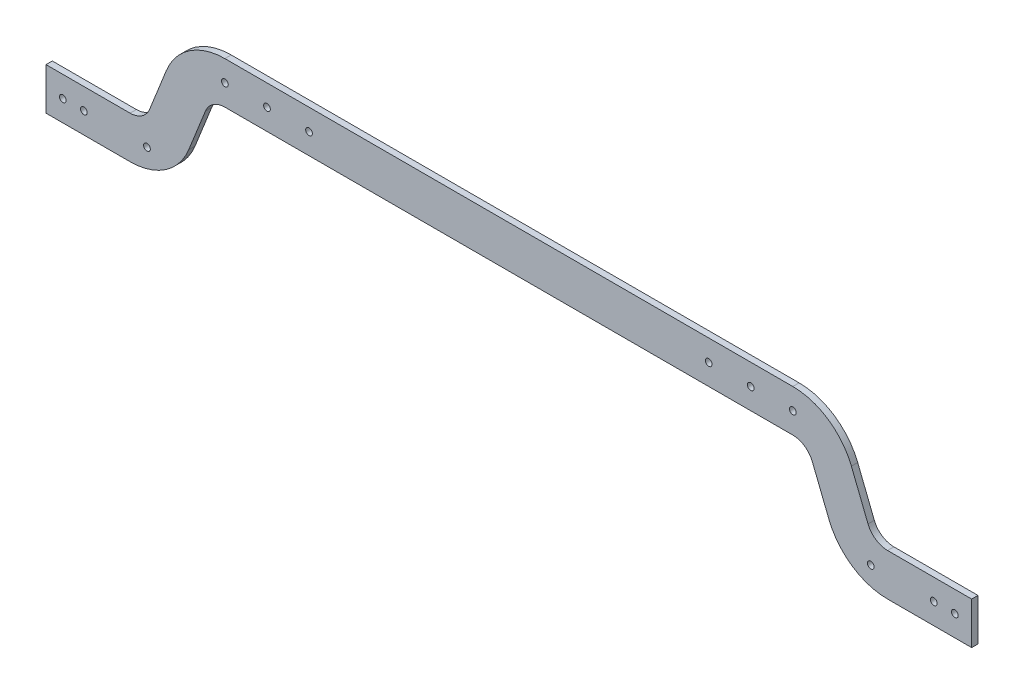
ISO-10303-21;
HEADER;
FILE_DESCRIPTION(('STEP AP214'),'2;1');
FILE_NAME('part.step','',(''),(''),'','','');
FILE_SCHEMA(('AUTOMOTIVE_DESIGN { 1 0 10303 214 1 1 1 1 }'));
ENDSEC;
DATA;
#1=APPLICATION_CONTEXT('core data for automotive mechanical design processes');
#2=APPLICATION_PROTOCOL_DEFINITION('international standard','automotive_design',2000,#1);
#3=PRODUCT_CONTEXT('',#1,'mechanical');
#4=PRODUCT('Part','Part','',(#3));
#5=PRODUCT_RELATED_PRODUCT_CATEGORY('part','',(#4));
#6=PRODUCT_DEFINITION_FORMATION('','',#4);
#7=PRODUCT_DEFINITION_CONTEXT('part definition',#1,'design');
#8=PRODUCT_DEFINITION('design','',#6,#7);
#9=PRODUCT_DEFINITION_SHAPE('','',#8);
#10=(LENGTH_UNIT() NAMED_UNIT(*) SI_UNIT(.MILLI.,.METRE.));
#11=(NAMED_UNIT(*) PLANE_ANGLE_UNIT() SI_UNIT($,.RADIAN.));
#12=(NAMED_UNIT(*) SI_UNIT($,.STERADIAN.) SOLID_ANGLE_UNIT());
#13=UNCERTAINTY_MEASURE_WITH_UNIT(LENGTH_MEASURE(1.E-05),#10,'distance_accuracy_value','');
#14=(GEOMETRIC_REPRESENTATION_CONTEXT(3) GLOBAL_UNCERTAINTY_ASSIGNED_CONTEXT((#13)) GLOBAL_UNIT_ASSIGNED_CONTEXT((#10,
#11,#12)) REPRESENTATION_CONTEXT('',''));
#15=CARTESIAN_POINT('',(0.,0.,0.));
#16=DIRECTION('',(0.,0.,1.));
#17=DIRECTION('',(1.,0.,0.));
#18=AXIS2_PLACEMENT_3D('',#15,#16,#17);
#19=CARTESIAN_POINT('',(-512.555561166034,145.,3.));
#20=DIRECTION('',(1.,0.,0.));
#21=DIRECTION('',(0.,0.,-1.));
#22=AXIS2_PLACEMENT_3D('',#19,#20,#21);
#23=PLANE('',#22);
#24=DIRECTION('',(0.,-1.,0.));
#25=VECTOR('',#24,1.);
#26=CARTESIAN_POINT('',(-512.555561166034,145.,0.));
#27=LINE('',#26,#25);
#28=CARTESIAN_POINT('',(-512.555561166034,165.,0.));
#29=VERTEX_POINT('',#28);
#30=CARTESIAN_POINT('',(-512.555561166034,145.,0.));
#31=VERTEX_POINT('',#30);
#32=EDGE_CURVE('E217',#29,#31,#27,.T.);
#33=ORIENTED_EDGE('',*,*,#32,.T.);
#34=DIRECTION('',(0.,0.,-1.));
#35=VECTOR('',#34,1.);
#36=CARTESIAN_POINT('',(-512.555561166034,145.,3.));
#37=LINE('',#36,#35);
#38=CARTESIAN_POINT('',(-512.555561166034,145.,3.));
#39=VERTEX_POINT('',#38);
#40=EDGE_CURVE('E13',#39,#31,#37,.T.);
#41=ORIENTED_EDGE('',*,*,#40,.F.);
#42=DIRECTION('',(0.,-1.,0.));
#43=VECTOR('',#42,1.);
#44=CARTESIAN_POINT('',(-512.555561166034,145.,3.));
#45=LINE('',#44,#43);
#46=CARTESIAN_POINT('',(-512.555561166034,165.,3.));
#47=VERTEX_POINT('',#46);
#48=EDGE_CURVE('E256',#47,#39,#45,.T.);
#49=ORIENTED_EDGE('',*,*,#48,.F.);
#50=DIRECTION('',(0.,0.,-1.));
#51=VECTOR('',#50,1.);
#52=CARTESIAN_POINT('',(-512.555561166034,165.,3.));
#53=LINE('',#52,#51);
#54=EDGE_CURVE('E213',#47,#29,#53,.T.);
#55=ORIENTED_EDGE('',*,*,#54,.T.);
#56=EDGE_LOOP('',(#33,#41,#49,#55));
#57=FACE_BOUND('',#56,.T.);
#58=ADVANCED_FACE('F49',(#57),#23,.F.);
#59=CARTESIAN_POINT('',(-512.555561166034,145.,3.));
#60=DIRECTION('',(0.,1.,0.));
#61=DIRECTION('',(0.,0.,1.));
#62=AXIS2_PLACEMENT_3D('',#59,#60,#61);
#63=PLANE('',#62);
#64=DIRECTION('',(1.,0.,0.));
#65=VECTOR('',#64,1.);
#66=CARTESIAN_POINT('',(-512.555561166034,145.,0.));
#67=LINE('',#66,#65);
#68=CARTESIAN_POINT('',(-472.555561166034,145.,0.));
#69=VERTEX_POINT('',#68);
#70=EDGE_CURVE('E220',#31,#69,#67,.T.);
#71=ORIENTED_EDGE('',*,*,#70,.T.);
#72=DIRECTION('',(0.,0.,-1.));
#73=VECTOR('',#72,1.);
#74=CARTESIAN_POINT('',(-472.555561166034,145.,3.));
#75=LINE('',#74,#73);
#76=CARTESIAN_POINT('',(-472.555561166034,145.,3.));
#77=VERTEX_POINT('',#76);
#78=EDGE_CURVE('E57',#77,#69,#75,.T.);
#79=ORIENTED_EDGE('',*,*,#78,.F.);
#80=DIRECTION('',(1.,0.,0.));
#81=VECTOR('',#80,1.);
#82=CARTESIAN_POINT('',(-512.555561166034,145.,3.));
#83=LINE('',#82,#81);
#84=EDGE_CURVE('E144',#39,#77,#83,.T.);
#85=ORIENTED_EDGE('',*,*,#84,.F.);
#86=ORIENTED_EDGE('',*,*,#40,.T.);
#87=EDGE_LOOP('',(#71,#79,#85,#86));
#88=FACE_BOUND('',#87,.T.);
#89=ADVANCED_FACE('F375',(#88),#63,.F.);
#90=CARTESIAN_POINT('',(-472.555561166034,175.,3.));
#91=DIRECTION('',(0.,0.,-1.));
#92=DIRECTION('',(-1.,0.,0.));
#93=AXIS2_PLACEMENT_3D('',#90,#91,#92);
#94=CYLINDRICAL_SURFACE('',#93,29.9999999999998);
#95=CARTESIAN_POINT('',(-472.555561166034,175.,0.));
#96=DIRECTION('',(0.,0.,1.));
#97=DIRECTION('',(1.,0.,0.));
#98=AXIS2_PLACEMENT_3D('',#95,#96,#97);
#99=CIRCLE('',#98,29.9999999999998);
#100=CARTESIAN_POINT('',(-444.689840432414,163.886872267632,0.));
#101=VERTEX_POINT('',#100);
#102=EDGE_CURVE('E223',#69,#101,#99,.T.);
#103=ORIENTED_EDGE('',*,*,#102,.T.);
#104=DIRECTION('',(0.,0.,-1.));
#105=VECTOR('',#104,1.);
#106=CARTESIAN_POINT('',(-444.689840432414,163.886872267632,3.));
#107=LINE('',#106,#105);
#108=CARTESIAN_POINT('',(-444.689840432414,163.886872267632,3.));
#109=VERTEX_POINT('',#108);
#110=EDGE_CURVE('E299',#109,#101,#107,.T.);
#111=ORIENTED_EDGE('',*,*,#110,.F.);
#112=CARTESIAN_POINT('',(-472.555561166034,175.,3.));
#113=DIRECTION('',(0.,0.,1.));
#114=DIRECTION('',(1.,0.,0.));
#115=AXIS2_PLACEMENT_3D('',#112,#113,#114);
#116=CIRCLE('',#115,29.9999999999998);
#117=EDGE_CURVE('E307',#77,#109,#116,.T.);
#118=ORIENTED_EDGE('',*,*,#117,.F.);
#119=ORIENTED_EDGE('',*,*,#78,.T.);
#120=EDGE_LOOP('',(#103,#111,#118,#119));
#121=FACE_BOUND('',#120,.T.);
#122=ADVANCED_FACE('F305',(#121),#94,.T.);
#123=CARTESIAN_POINT('',(-436.785621791445,183.706382541521,3.));
#124=DIRECTION('',(-0.928857357787315,0.370437591078939,0.));
#125=DIRECTION('',(-0.370437591078939,-0.928857357787315,0.));
#126=AXIS2_PLACEMENT_3D('',#123,#124,#125);
#127=PLANE('',#126);
#128=DIRECTION('',(0.370437591078939,0.928857357787315,0.));
#129=VECTOR('',#128,1.);
#130=CARTESIAN_POINT('',(-436.785621791445,183.706382541521,0.));
#131=LINE('',#130,#129);
#132=CARTESIAN_POINT('',(-436.785621791445,183.706382541521,0.));
#133=VERTEX_POINT('',#132);
#134=EDGE_CURVE('E225',#101,#133,#131,.T.);
#135=ORIENTED_EDGE('',*,*,#134,.T.);
#136=DIRECTION('',(0.,0.,-1.));
#137=VECTOR('',#136,1.);
#138=CARTESIAN_POINT('',(-436.785621791445,183.706382541521,3.));
#139=LINE('',#138,#137);
#140=CARTESIAN_POINT('',(-436.785621791445,183.706382541521,3.));
#141=VERTEX_POINT('',#140);
#142=EDGE_CURVE('E296',#141,#133,#139,.T.);
#143=ORIENTED_EDGE('',*,*,#142,.F.);
#144=DIRECTION('',(0.370437591078939,0.928857357787315,0.));
#145=VECTOR('',#144,1.);
#146=CARTESIAN_POINT('',(-436.785621791445,183.706382541521,3.));
#147=LINE('',#146,#145);
#148=EDGE_CURVE('E325',#109,#141,#147,.T.);
#149=ORIENTED_EDGE('',*,*,#148,.F.);
#150=ORIENTED_EDGE('',*,*,#110,.T.);
#151=EDGE_LOOP('',(#135,#143,#149,#150));
#152=FACE_BOUND('',#151,.T.);
#153=ADVANCED_FACE('F316',(#152),#127,.F.);
#154=CARTESIAN_POINT('',(-427.497048213572,180.002006630731,3.));
#155=DIRECTION('',(0.,0.,-1.));
#156=DIRECTION('',(-1.,0.,0.));
#157=AXIS2_PLACEMENT_3D('',#154,#155,#156);
#158=CYLINDRICAL_SURFACE('',#157,10.);
#159=CARTESIAN_POINT('',(-427.497048213572,180.002006630731,0.));
#160=DIRECTION('',(0.,0.,-1.));
#161=DIRECTION('',(1.,0.,0.));
#162=AXIS2_PLACEMENT_3D('',#159,#160,#161);
#163=CIRCLE('',#162,10.);
#164=CARTESIAN_POINT('',(-427.497048213572,190.002006630731,0.));
#165=VERTEX_POINT('',#164);
#166=EDGE_CURVE('E227',#133,#165,#163,.T.);
#167=ORIENTED_EDGE('',*,*,#166,.T.);
#168=DIRECTION('',(0.,0.,-1.));
#169=VECTOR('',#168,1.);
#170=CARTESIAN_POINT('',(-427.497048213572,190.002006630731,3.));
#171=LINE('',#170,#169);
#172=CARTESIAN_POINT('',(-427.497048213572,190.002006630731,3.));
#173=VERTEX_POINT('',#172);
#174=EDGE_CURVE('E293',#173,#165,#171,.T.);
#175=ORIENTED_EDGE('',*,*,#174,.F.);
#176=CARTESIAN_POINT('',(-427.497048213572,180.002006630731,3.));
#177=DIRECTION('',(0.,0.,-1.));
#178=DIRECTION('',(1.,0.,0.));
#179=AXIS2_PLACEMENT_3D('',#176,#177,#178);
#180=CIRCLE('',#179,10.);
#181=EDGE_CURVE('E322',#141,#173,#180,.T.);
#182=ORIENTED_EDGE('',*,*,#181,.F.);
#183=ORIENTED_EDGE('',*,*,#142,.T.);
#184=EDGE_LOOP('',(#167,#175,#182,#183));
#185=FACE_BOUND('',#184,.T.);
#186=ADVANCED_FACE('F320',(#185),#158,.F.);
#187=CARTESIAN_POINT('',(-157.497048213572,190.002006630731,3.));
#188=DIRECTION('',(0.,1.,0.));
#189=DIRECTION('',(0.,0.,1.));
#190=AXIS2_PLACEMENT_3D('',#187,#188,#189);
#191=PLANE('',#190);
#192=DIRECTION('',(1.,0.,0.));
#193=VECTOR('',#192,1.);
#194=CARTESIAN_POINT('',(-157.497048213572,190.002006630731,0.));
#195=LINE('',#194,#193);
#196=CARTESIAN_POINT('',(-157.497048213572,190.002006630731,0.));
#197=VERTEX_POINT('',#196);
#198=EDGE_CURVE('E229',#165,#197,#195,.T.);
#199=ORIENTED_EDGE('',*,*,#198,.T.);
#200=DIRECTION('',(0.,0.,-1.));
#201=VECTOR('',#200,1.);
#202=CARTESIAN_POINT('',(-157.497048213572,190.002006630731,3.));
#203=LINE('',#202,#201);
#204=CARTESIAN_POINT('',(-157.497048213572,190.002006630731,3.));
#205=VERTEX_POINT('',#204);
#206=EDGE_CURVE('E290',#205,#197,#203,.T.);
#207=ORIENTED_EDGE('',*,*,#206,.F.);
#208=DIRECTION('',(1.,0.,0.));
#209=VECTOR('',#208,1.);
#210=CARTESIAN_POINT('',(-157.497048213572,190.002006630731,3.));
#211=LINE('',#210,#209);
#212=EDGE_CURVE('E324',#173,#205,#211,.T.);
#213=ORIENTED_EDGE('',*,*,#212,.F.);
#214=ORIENTED_EDGE('',*,*,#174,.T.);
#215=EDGE_LOOP('',(#199,#207,#213,#214));
#216=FACE_BOUND('',#215,.T.);
#217=ADVANCED_FACE('F388',(#216),#191,.F.);
#218=CARTESIAN_POINT('',(-157.497048213572,180.002006630731,3.));
#219=DIRECTION('',(0.,0.,-1.));
#220=DIRECTION('',(-1.,0.,0.));
#221=AXIS2_PLACEMENT_3D('',#218,#219,#220);
#222=CYLINDRICAL_SURFACE('',#221,10.);
#223=CARTESIAN_POINT('',(-157.497048213572,180.002006630731,0.));
#224=DIRECTION('',(0.,0.,-1.));
#225=DIRECTION('',(-1.,0.,0.));
#226=AXIS2_PLACEMENT_3D('',#223,#224,#225);
#227=CIRCLE('',#226,10.);
#228=CARTESIAN_POINT('',(-148.208474635699,183.706382541521,0.));
#229=VERTEX_POINT('',#228);
#230=EDGE_CURVE('E231',#197,#229,#227,.T.);
#231=ORIENTED_EDGE('',*,*,#230,.T.);
#232=DIRECTION('',(0.,0.,-1.));
#233=VECTOR('',#232,1.);
#234=CARTESIAN_POINT('',(-148.208474635699,183.706382541521,3.));
#235=LINE('',#234,#233);
#236=CARTESIAN_POINT('',(-148.208474635699,183.706382541521,3.));
#237=VERTEX_POINT('',#236);
#238=EDGE_CURVE('E287',#237,#229,#235,.T.);
#239=ORIENTED_EDGE('',*,*,#238,.F.);
#240=CARTESIAN_POINT('',(-157.497048213572,180.002006630731,3.));
#241=DIRECTION('',(0.,0.,-1.));
#242=DIRECTION('',(-1.,0.,0.));
#243=AXIS2_PLACEMENT_3D('',#240,#241,#242);
#244=CIRCLE('',#243,10.);
#245=EDGE_CURVE('E327',#205,#237,#244,.T.);
#246=ORIENTED_EDGE('',*,*,#245,.F.);
#247=ORIENTED_EDGE('',*,*,#206,.T.);
#248=EDGE_LOOP('',(#231,#239,#246,#247));
#249=FACE_BOUND('',#248,.T.);
#250=ADVANCED_FACE('F391',(#249),#222,.F.);
#251=CARTESIAN_POINT('',(-148.208474635699,183.706382541521,3.));
#252=DIRECTION('',(0.928857357787315,0.370437591078939,0.));
#253=DIRECTION('',(-0.370437591078939,0.928857357787315,0.));
#254=AXIS2_PLACEMENT_3D('',#251,#252,#253);
#255=PLANE('',#254);
#256=DIRECTION('',(0.370437591078939,-0.928857357787315,0.));
#257=VECTOR('',#256,1.);
#258=CARTESIAN_POINT('',(-148.208474635699,183.706382541521,0.));
#259=LINE('',#258,#257);
#260=CARTESIAN_POINT('',(-140.30425599473,163.886872267632,0.));
#261=VERTEX_POINT('',#260);
#262=EDGE_CURVE('E233',#229,#261,#259,.T.);
#263=ORIENTED_EDGE('',*,*,#262,.T.);
#264=DIRECTION('',(0.,0.,-1.));
#265=VECTOR('',#264,1.);
#266=CARTESIAN_POINT('',(-140.30425599473,163.886872267632,3.));
#267=LINE('',#266,#265);
#268=CARTESIAN_POINT('',(-140.30425599473,163.886872267632,3.));
#269=VERTEX_POINT('',#268);
#270=EDGE_CURVE('E284',#269,#261,#267,.T.);
#271=ORIENTED_EDGE('',*,*,#270,.F.);
#272=DIRECTION('',(0.370437591078939,-0.928857357787315,0.));
#273=VECTOR('',#272,1.);
#274=CARTESIAN_POINT('',(-148.208474635699,183.706382541521,3.));
#275=LINE('',#274,#273);
#276=EDGE_CURVE('E333',#237,#269,#275,.T.);
#277=ORIENTED_EDGE('',*,*,#276,.F.);
#278=ORIENTED_EDGE('',*,*,#238,.T.);
#279=EDGE_LOOP('',(#263,#271,#277,#278));
#280=FACE_BOUND('',#279,.T.);
#281=ADVANCED_FACE('F395',(#280),#255,.F.);
#282=CARTESIAN_POINT('',(-112.438535261111,175.,3.));
#283=DIRECTION('',(0.,0.,-1.));
#284=DIRECTION('',(-1.,0.,0.));
#285=AXIS2_PLACEMENT_3D('',#282,#283,#284);
#286=CYLINDRICAL_SURFACE('',#285,29.9999999999998);
#287=CARTESIAN_POINT('',(-112.438535261111,175.,0.));
#288=DIRECTION('',(0.,0.,1.));
#289=DIRECTION('',(-1.,0.,0.));
#290=AXIS2_PLACEMENT_3D('',#287,#288,#289);
#291=CIRCLE('',#290,29.9999999999998);
#292=CARTESIAN_POINT('',(-112.438535261111,145.,0.));
#293=VERTEX_POINT('',#292);
#294=EDGE_CURVE('E235',#261,#293,#291,.T.);
#295=ORIENTED_EDGE('',*,*,#294,.T.);
#296=DIRECTION('',(0.,0.,-1.));
#297=VECTOR('',#296,1.);
#298=CARTESIAN_POINT('',(-112.438535261111,145.,3.));
#299=LINE('',#298,#297);
#300=CARTESIAN_POINT('',(-112.438535261111,145.,3.));
#301=VERTEX_POINT('',#300);
#302=EDGE_CURVE('E281',#301,#293,#299,.T.);
#303=ORIENTED_EDGE('',*,*,#302,.F.);
#304=CARTESIAN_POINT('',(-112.438535261111,175.,3.));
#305=DIRECTION('',(0.,0.,1.));
#306=DIRECTION('',(-1.,0.,0.));
#307=AXIS2_PLACEMENT_3D('',#304,#305,#306);
#308=CIRCLE('',#307,29.9999999999998);
#309=EDGE_CURVE('E335',#269,#301,#308,.T.);
#310=ORIENTED_EDGE('',*,*,#309,.F.);
#311=ORIENTED_EDGE('',*,*,#270,.T.);
#312=EDGE_LOOP('',(#295,#303,#310,#311));
#313=FACE_BOUND('',#312,.T.);
#314=ADVANCED_FACE('F399',(#313),#286,.T.);
#315=CARTESIAN_POINT('',(-72.4385352611108,145.,3.));
#316=DIRECTION('',(0.,1.,0.));
#317=DIRECTION('',(0.,0.,1.));
#318=AXIS2_PLACEMENT_3D('',#315,#316,#317);
#319=PLANE('',#318);
#320=DIRECTION('',(1.,0.,0.));
#321=VECTOR('',#320,1.);
#322=CARTESIAN_POINT('',(-72.4385352611108,145.,0.));
#323=LINE('',#322,#321);
#324=CARTESIAN_POINT('',(-72.4385352611108,145.,0.));
#325=VERTEX_POINT('',#324);
#326=EDGE_CURVE('E237',#293,#325,#323,.T.);
#327=ORIENTED_EDGE('',*,*,#326,.T.);
#328=DIRECTION('',(0.,0.,-1.));
#329=VECTOR('',#328,1.);
#330=CARTESIAN_POINT('',(-72.4385352611108,145.,3.));
#331=LINE('',#330,#329);
#332=CARTESIAN_POINT('',(-72.4385352611108,145.,3.));
#333=VERTEX_POINT('',#332);
#334=EDGE_CURVE('E278',#333,#325,#331,.T.);
#335=ORIENTED_EDGE('',*,*,#334,.F.);
#336=DIRECTION('',(1.,0.,0.));
#337=VECTOR('',#336,1.);
#338=CARTESIAN_POINT('',(-72.4385352611108,145.,3.));
#339=LINE('',#338,#337);
#340=EDGE_CURVE('E337',#301,#333,#339,.T.);
#341=ORIENTED_EDGE('',*,*,#340,.F.);
#342=ORIENTED_EDGE('',*,*,#302,.T.);
#343=EDGE_LOOP('',(#327,#335,#341,#342));
#344=FACE_BOUND('',#343,.T.);
#345=ADVANCED_FACE('F403',(#344),#319,.F.);
#346=CARTESIAN_POINT('',(-72.4385352611108,145.,3.));
#347=DIRECTION('',(-1.,0.,0.));
#348=DIRECTION('',(0.,0.,1.));
#349=AXIS2_PLACEMENT_3D('',#346,#347,#348);
#350=PLANE('',#349);
#351=DIRECTION('',(0.,1.,0.));
#352=VECTOR('',#351,1.);
#353=CARTESIAN_POINT('',(-72.4385352611108,145.,0.));
#354=LINE('',#353,#352);
#355=CARTESIAN_POINT('',(-72.4385352611108,165.,0.));
#356=VERTEX_POINT('',#355);
#357=EDGE_CURVE('E239',#325,#356,#354,.T.);
#358=ORIENTED_EDGE('',*,*,#357,.T.);
#359=DIRECTION('',(0.,0.,-1.));
#360=VECTOR('',#359,1.);
#361=CARTESIAN_POINT('',(-72.4385352611108,165.,3.));
#362=LINE('',#361,#360);
#363=CARTESIAN_POINT('',(-72.4385352611108,165.,3.));
#364=VERTEX_POINT('',#363);
#365=EDGE_CURVE('E275',#364,#356,#362,.T.);
#366=ORIENTED_EDGE('',*,*,#365,.F.);
#367=DIRECTION('',(0.,1.,0.));
#368=VECTOR('',#367,1.);
#369=CARTESIAN_POINT('',(-72.4385352611108,145.,3.));
#370=LINE('',#369,#368);
#371=EDGE_CURVE('E339',#333,#364,#370,.T.);
#372=ORIENTED_EDGE('',*,*,#371,.F.);
#373=ORIENTED_EDGE('',*,*,#334,.T.);
#374=EDGE_LOOP('',(#358,#366,#372,#373));
#375=FACE_BOUND('',#374,.T.);
#376=ADVANCED_FACE('F407',(#375),#350,.F.);
#377=CARTESIAN_POINT('',(-72.4385352611108,165.,3.));
#378=DIRECTION('',(0.,-1.,0.));
#379=DIRECTION('',(0.,0.,-1.));
#380=AXIS2_PLACEMENT_3D('',#377,#378,#379);
#381=PLANE('',#380);
#382=DIRECTION('',(-1.,0.,0.));
#383=VECTOR('',#382,1.);
#384=CARTESIAN_POINT('',(-72.4385352611108,165.,0.));
#385=LINE('',#384,#383);
#386=CARTESIAN_POINT('',(-112.438535261111,165.,0.));
#387=VERTEX_POINT('',#386);
#388=EDGE_CURVE('E241',#356,#387,#385,.T.);
#389=ORIENTED_EDGE('',*,*,#388,.T.);
#390=DIRECTION('',(0.,0.,-1.));
#391=VECTOR('',#390,1.);
#392=CARTESIAN_POINT('',(-112.438535261111,165.,3.));
#393=LINE('',#392,#391);
#394=CARTESIAN_POINT('',(-112.438535261111,165.,3.));
#395=VERTEX_POINT('',#394);
#396=EDGE_CURVE('E272',#395,#387,#393,.T.);
#397=ORIENTED_EDGE('',*,*,#396,.F.);
#398=DIRECTION('',(-1.,0.,0.));
#399=VECTOR('',#398,1.);
#400=CARTESIAN_POINT('',(-72.4385352611108,165.,3.));
#401=LINE('',#400,#399);
#402=EDGE_CURVE('E341',#364,#395,#401,.T.);
#403=ORIENTED_EDGE('',*,*,#402,.F.);
#404=ORIENTED_EDGE('',*,*,#365,.T.);
#405=EDGE_LOOP('',(#389,#397,#403,#404));
#406=FACE_BOUND('',#405,.T.);
#407=ADVANCED_FACE('F411',(#406),#381,.F.);
#408=CARTESIAN_POINT('',(-112.438535261111,175.,3.));
#409=DIRECTION('',(0.,0.,-1.));
#410=DIRECTION('',(-1.,0.,0.));
#411=AXIS2_PLACEMENT_3D('',#408,#409,#410);
#412=CYLINDRICAL_SURFACE('',#411,9.99999999999992);
#413=CARTESIAN_POINT('',(-112.438535261111,175.,0.));
#414=DIRECTION('',(0.,0.,-1.));
#415=DIRECTION('',(-1.,0.,0.));
#416=AXIS2_PLACEMENT_3D('',#413,#414,#415);
#417=CIRCLE('',#416,9.99999999999992);
#418=CARTESIAN_POINT('',(-121.727108838984,171.29562408921,0.));
#419=VERTEX_POINT('',#418);
#420=EDGE_CURVE('E243',#387,#419,#417,.T.);
#421=ORIENTED_EDGE('',*,*,#420,.T.);
#422=DIRECTION('',(0.,0.,-1.));
#423=VECTOR('',#422,1.);
#424=CARTESIAN_POINT('',(-121.727108838984,171.29562408921,3.));
#425=LINE('',#424,#423);
#426=CARTESIAN_POINT('',(-121.727108838984,171.29562408921,3.));
#427=VERTEX_POINT('',#426);
#428=EDGE_CURVE('E269',#427,#419,#425,.T.);
#429=ORIENTED_EDGE('',*,*,#428,.F.);
#430=CARTESIAN_POINT('',(-112.438535261111,175.,3.));
#431=DIRECTION('',(0.,0.,-1.));
#432=DIRECTION('',(-1.,0.,0.));
#433=AXIS2_PLACEMENT_3D('',#430,#431,#432);
#434=CIRCLE('',#433,9.99999999999992);
#435=EDGE_CURVE('E343',#395,#427,#434,.T.);
#436=ORIENTED_EDGE('',*,*,#435,.F.);
#437=ORIENTED_EDGE('',*,*,#396,.T.);
#438=EDGE_LOOP('',(#421,#429,#436,#437));
#439=FACE_BOUND('',#438,.T.);
#440=ADVANCED_FACE('F415',(#439),#412,.F.);
#441=CARTESIAN_POINT('',(-129.631327479953,191.115134363099,3.));
#442=DIRECTION('',(-0.928857357787316,-0.370437591078938,0.));
#443=DIRECTION('',(0.370437591078938,-0.928857357787316,0.));
#444=AXIS2_PLACEMENT_3D('',#441,#442,#443);
#445=PLANE('',#444);
#446=DIRECTION('',(-0.370437591078938,0.928857357787316,0.));
#447=VECTOR('',#446,1.);
#448=CARTESIAN_POINT('',(-129.631327479953,191.115134363099,0.));
#449=LINE('',#448,#447);
#450=CARTESIAN_POINT('',(-129.631327479953,191.115134363099,0.));
#451=VERTEX_POINT('',#450);
#452=EDGE_CURVE('E245',#419,#451,#449,.T.);
#453=ORIENTED_EDGE('',*,*,#452,.T.);
#454=DIRECTION('',(0.,0.,-1.));
#455=VECTOR('',#454,1.);
#456=CARTESIAN_POINT('',(-129.631327479953,191.115134363099,3.));
#457=LINE('',#456,#455);
#458=CARTESIAN_POINT('',(-129.631327479953,191.115134363099,3.));
#459=VERTEX_POINT('',#458);
#460=EDGE_CURVE('E266',#459,#451,#457,.T.);
#461=ORIENTED_EDGE('',*,*,#460,.F.);
#462=DIRECTION('',(-0.370437591078938,0.928857357787316,0.));
#463=VECTOR('',#462,1.);
#464=CARTESIAN_POINT('',(-129.631327479953,191.115134363099,3.));
#465=LINE('',#464,#463);
#466=EDGE_CURVE('E345',#427,#459,#465,.T.);
#467=ORIENTED_EDGE('',*,*,#466,.F.);
#468=ORIENTED_EDGE('',*,*,#428,.T.);
#469=EDGE_LOOP('',(#453,#461,#467,#468));
#470=FACE_BOUND('',#469,.T.);
#471=ADVANCED_FACE('F419',(#470),#445,.F.);
#472=CARTESIAN_POINT('',(-157.497048213572,180.002006630731,3.));
#473=DIRECTION('',(0.,0.,-1.));
#474=DIRECTION('',(-1.,0.,0.));
#475=AXIS2_PLACEMENT_3D('',#472,#473,#474);
#476=CYLINDRICAL_SURFACE('',#475,29.9999999999998);
#477=CARTESIAN_POINT('',(-157.497048213572,180.002006630731,0.));
#478=DIRECTION('',(0.,0.,1.));
#479=DIRECTION('',(-1.,0.,0.));
#480=AXIS2_PLACEMENT_3D('',#477,#478,#479);
#481=CIRCLE('',#480,29.9999999999998);
#482=CARTESIAN_POINT('',(-157.497048213572,210.002006630731,0.));
#483=VERTEX_POINT('',#482);
#484=EDGE_CURVE('E247',#451,#483,#481,.T.);
#485=ORIENTED_EDGE('',*,*,#484,.T.);
#486=DIRECTION('',(0.,0.,-1.));
#487=VECTOR('',#486,1.);
#488=CARTESIAN_POINT('',(-157.497048213572,210.002006630731,3.));
#489=LINE('',#488,#487);
#490=CARTESIAN_POINT('',(-157.497048213572,210.002006630731,3.));
#491=VERTEX_POINT('',#490);
#492=EDGE_CURVE('E263',#491,#483,#489,.T.);
#493=ORIENTED_EDGE('',*,*,#492,.F.);
#494=CARTESIAN_POINT('',(-157.497048213572,180.002006630731,3.));
#495=DIRECTION('',(0.,0.,1.));
#496=DIRECTION('',(-1.,0.,0.));
#497=AXIS2_PLACEMENT_3D('',#494,#495,#496);
#498=CIRCLE('',#497,29.9999999999998);
#499=EDGE_CURVE('E347',#459,#491,#498,.T.);
#500=ORIENTED_EDGE('',*,*,#499,.F.);
#501=ORIENTED_EDGE('',*,*,#460,.T.);
#502=EDGE_LOOP('',(#485,#493,#500,#501));
#503=FACE_BOUND('',#502,.T.);
#504=ADVANCED_FACE('F423',(#503),#476,.T.);
#505=CARTESIAN_POINT('',(-157.497048213572,210.002006630731,3.));
#506=DIRECTION('',(0.,-1.,0.));
#507=DIRECTION('',(0.,0.,-1.));
#508=AXIS2_PLACEMENT_3D('',#505,#506,#507);
#509=PLANE('',#508);
#510=DIRECTION('',(-1.,0.,0.));
#511=VECTOR('',#510,1.);
#512=CARTESIAN_POINT('',(-157.497048213572,210.002006630731,0.));
#513=LINE('',#512,#511);
#514=CARTESIAN_POINT('',(-427.497048213572,210.002006630731,0.));
#515=VERTEX_POINT('',#514);
#516=EDGE_CURVE('E249',#483,#515,#513,.T.);
#517=ORIENTED_EDGE('',*,*,#516,.T.);
#518=DIRECTION('',(0.,0.,-1.));
#519=VECTOR('',#518,1.);
#520=CARTESIAN_POINT('',(-427.497048213572,210.002006630731,3.));
#521=LINE('',#520,#519);
#522=CARTESIAN_POINT('',(-427.497048213572,210.002006630731,3.));
#523=VERTEX_POINT('',#522);
#524=EDGE_CURVE('E260',#523,#515,#521,.T.);
#525=ORIENTED_EDGE('',*,*,#524,.F.);
#526=DIRECTION('',(-1.,0.,0.));
#527=VECTOR('',#526,1.);
#528=CARTESIAN_POINT('',(-157.497048213572,210.002006630731,3.));
#529=LINE('',#528,#527);
#530=EDGE_CURVE('E349',#491,#523,#529,.T.);
#531=ORIENTED_EDGE('',*,*,#530,.F.);
#532=ORIENTED_EDGE('',*,*,#492,.T.);
#533=EDGE_LOOP('',(#517,#525,#531,#532));
#534=FACE_BOUND('',#533,.T.);
#535=ADVANCED_FACE('F355',(#534),#509,.F.);
#536=CARTESIAN_POINT('',(-427.497048213572,180.002006630731,3.));
#537=DIRECTION('',(0.,0.,-1.));
#538=DIRECTION('',(-1.,0.,0.));
#539=AXIS2_PLACEMENT_3D('',#536,#537,#538);
#540=CYLINDRICAL_SURFACE('',#539,29.9999999999998);
#541=CARTESIAN_POINT('',(-427.497048213572,180.002006630731,0.));
#542=DIRECTION('',(0.,0.,1.));
#543=DIRECTION('',(1.,0.,0.));
#544=AXIS2_PLACEMENT_3D('',#541,#542,#543);
#545=CIRCLE('',#544,29.9999999999998);
#546=CARTESIAN_POINT('',(-455.362768947192,191.115134363099,0.));
#547=VERTEX_POINT('',#546);
#548=EDGE_CURVE('E251',#515,#547,#545,.T.);
#549=ORIENTED_EDGE('',*,*,#548,.T.);
#550=DIRECTION('',(0.,0.,-1.));
#551=VECTOR('',#550,1.);
#552=CARTESIAN_POINT('',(-455.362768947192,191.115134363099,3.));
#553=LINE('',#552,#551);
#554=CARTESIAN_POINT('',(-455.362768947192,191.115134363099,3.));
#555=VERTEX_POINT('',#554);
#556=EDGE_CURVE('E208',#555,#547,#553,.T.);
#557=ORIENTED_EDGE('',*,*,#556,.F.);
#558=CARTESIAN_POINT('',(-427.497048213572,180.002006630731,3.));
#559=DIRECTION('',(0.,0.,1.));
#560=DIRECTION('',(1.,0.,0.));
#561=AXIS2_PLACEMENT_3D('',#558,#559,#560);
#562=CIRCLE('',#561,29.9999999999998);
#563=EDGE_CURVE('E199',#523,#555,#562,.T.);
#564=ORIENTED_EDGE('',*,*,#563,.F.);
#565=ORIENTED_EDGE('',*,*,#524,.T.);
#566=EDGE_LOOP('',(#549,#557,#564,#565));
#567=FACE_BOUND('',#566,.T.);
#568=ADVANCED_FACE('F359',(#567),#540,.T.);
#569=CARTESIAN_POINT('',(-455.362768947192,191.115134363099,3.));
#570=DIRECTION('',(0.928857357787316,-0.370437591078938,0.));
#571=DIRECTION('',(0.370437591078938,0.928857357787316,0.));
#572=AXIS2_PLACEMENT_3D('',#569,#570,#571);
#573=PLANE('',#572);
#574=DIRECTION('',(-0.370437591078938,-0.928857357787316,0.));
#575=VECTOR('',#574,1.);
#576=CARTESIAN_POINT('',(-455.362768947192,191.115134363099,0.));
#577=LINE('',#576,#575);
#578=CARTESIAN_POINT('',(-463.26698758816,171.29562408921,0.));
#579=VERTEX_POINT('',#578);
#580=EDGE_CURVE('E207',#547,#579,#577,.T.);
#581=ORIENTED_EDGE('',*,*,#580,.T.);
#582=DIRECTION('',(0.,0.,-1.));
#583=VECTOR('',#582,1.);
#584=CARTESIAN_POINT('',(-463.26698758816,171.29562408921,3.));
#585=LINE('',#584,#583);
#586=CARTESIAN_POINT('',(-463.26698758816,171.29562408921,3.));
#587=VERTEX_POINT('',#586);
#588=EDGE_CURVE('E204',#587,#579,#585,.T.);
#589=ORIENTED_EDGE('',*,*,#588,.F.);
#590=DIRECTION('',(-0.370437591078938,-0.928857357787316,0.));
#591=VECTOR('',#590,1.);
#592=CARTESIAN_POINT('',(-455.362768947192,191.115134363099,3.));
#593=LINE('',#592,#591);
#594=EDGE_CURVE('E193',#555,#587,#593,.T.);
#595=ORIENTED_EDGE('',*,*,#594,.F.);
#596=ORIENTED_EDGE('',*,*,#556,.T.);
#597=EDGE_LOOP('',(#581,#589,#595,#596));
#598=FACE_BOUND('',#597,.T.);
#599=ADVANCED_FACE('F205',(#598),#573,.F.);
#600=CARTESIAN_POINT('',(-472.555561166034,175.,3.));
#601=DIRECTION('',(0.,0.,-1.));
#602=DIRECTION('',(-1.,0.,0.));
#603=AXIS2_PLACEMENT_3D('',#600,#601,#602);
#604=CYLINDRICAL_SURFACE('',#603,9.99999999999992);
#605=CARTESIAN_POINT('',(-472.555561166034,175.,0.));
#606=DIRECTION('',(0.,0.,-1.));
#607=DIRECTION('',(1.,0.,0.));
#608=AXIS2_PLACEMENT_3D('',#605,#606,#607);
#609=CIRCLE('',#608,9.99999999999992);
#610=CARTESIAN_POINT('',(-472.555561166034,165.,0.));
#611=VERTEX_POINT('',#610);
#612=EDGE_CURVE('E130',#579,#611,#609,.T.);
#613=ORIENTED_EDGE('',*,*,#612,.T.);
#614=DIRECTION('',(0.,0.,-1.));
#615=VECTOR('',#614,1.);
#616=CARTESIAN_POINT('',(-472.555561166034,165.,3.));
#617=LINE('',#616,#615);
#618=CARTESIAN_POINT('',(-472.555561166034,165.,3.));
#619=VERTEX_POINT('',#618);
#620=EDGE_CURVE('E209',#619,#611,#617,.T.);
#621=ORIENTED_EDGE('',*,*,#620,.F.);
#622=CARTESIAN_POINT('',(-472.555561166034,175.,3.));
#623=DIRECTION('',(0.,0.,-1.));
#624=DIRECTION('',(1.,0.,0.));
#625=AXIS2_PLACEMENT_3D('',#622,#623,#624);
#626=CIRCLE('',#625,9.99999999999992);
#627=EDGE_CURVE('E197',#587,#619,#626,.T.);
#628=ORIENTED_EDGE('',*,*,#627,.F.);
#629=ORIENTED_EDGE('',*,*,#588,.T.);
#630=EDGE_LOOP('',(#613,#621,#628,#629));
#631=FACE_BOUND('',#630,.T.);
#632=ADVANCED_FACE('F211',(#631),#604,.F.);
#633=CARTESIAN_POINT('',(-512.555561166034,165.,3.));
#634=DIRECTION('',(0.,-1.,0.));
#635=DIRECTION('',(0.,0.,-1.));
#636=AXIS2_PLACEMENT_3D('',#633,#634,#635);
#637=PLANE('',#636);
#638=DIRECTION('',(-1.,0.,0.));
#639=VECTOR('',#638,1.);
#640=CARTESIAN_POINT('',(-512.555561166034,165.,0.));
#641=LINE('',#640,#639);
#642=EDGE_CURVE('E136',#611,#29,#641,.T.);
#643=ORIENTED_EDGE('',*,*,#642,.T.);
#644=ORIENTED_EDGE('',*,*,#54,.F.);
#645=DIRECTION('',(-1.,0.,0.));
#646=VECTOR('',#645,1.);
#647=CARTESIAN_POINT('',(-512.555561166034,165.,3.));
#648=LINE('',#647,#646);
#649=EDGE_CURVE('E65',#619,#47,#648,.T.);
#650=ORIENTED_EDGE('',*,*,#649,.F.);
#651=ORIENTED_EDGE('',*,*,#620,.T.);
#652=EDGE_LOOP('',(#643,#644,#650,#651));
#653=FACE_BOUND('',#652,.T.);
#654=ADVANCED_FACE('F363',(#653),#637,.F.);
#655=CARTESIAN_POINT('',(-472.555561166034,175.,3.));
#656=DIRECTION('',(0.,0.,1.));
#657=DIRECTION('',(1.,0.,0.));
#658=AXIS2_PLACEMENT_3D('',#655,#656,#657);
#659=PLANE('',#658);
#660=CARTESIAN_POINT('',(-177.497048213572,199.952453990143,3.));
#661=DIRECTION('',(0.,0.,1.));
#662=DIRECTION('',(-1.,0.,0.));
#663=AXIS2_PLACEMENT_3D('',#660,#661,#662);
#664=CIRCLE('',#663,1.59999999999996);
#665=CARTESIAN_POINT('',(-179.097048213572,199.952453990143,3.));
#666=VERTEX_POINT('',#665);
#667=EDGE_CURVE('E709',#666,#666,#664,.T.);
#668=ORIENTED_EDGE('',*,*,#667,.F.);
#669=EDGE_LOOP('',(#668));
#670=FACE_BOUND('',#669,.T.);
#671=CARTESIAN_POINT('',(-197.497048213572,199.902901349556,3.));
#672=DIRECTION('',(0.,0.,1.));
#673=DIRECTION('',(-1.,0.,0.));
#674=AXIS2_PLACEMENT_3D('',#671,#672,#673);
#675=CIRCLE('',#674,1.59999999999996);
#676=CARTESIAN_POINT('',(-199.097048213572,199.902901349556,3.));
#677=VERTEX_POINT('',#676);
#678=EDGE_CURVE('E712',#677,#677,#675,.T.);
#679=ORIENTED_EDGE('',*,*,#678,.F.);
#680=EDGE_LOOP('',(#679));
#681=FACE_BOUND('',#680,.T.);
#682=CARTESIAN_POINT('',(-80.4385352611108,155.,3.));
#683=DIRECTION('',(0.,0.,1.));
#684=DIRECTION('',(-1.,0.,0.));
#685=AXIS2_PLACEMENT_3D('',#682,#683,#684);
#686=CIRCLE('',#685,1.60000000000002);
#687=CARTESIAN_POINT('',(-82.0385352611108,155.,3.));
#688=VERTEX_POINT('',#687);
#689=EDGE_CURVE('E771',#688,#688,#686,.T.);
#690=ORIENTED_EDGE('',*,*,#689,.F.);
#691=EDGE_LOOP('',(#690));
#692=FACE_BOUND('',#691,.T.);
#693=CARTESIAN_POINT('',(-504.555561166034,155.,3.));
#694=DIRECTION('',(0.,0.,1.));
#695=DIRECTION('',(1.,0.,0.));
#696=AXIS2_PLACEMENT_3D('',#693,#694,#695);
#697=CIRCLE('',#696,1.60000000000002);
#698=CARTESIAN_POINT('',(-502.955561166034,155.,3.));
#699=VERTEX_POINT('',#698);
#700=EDGE_CURVE('E758',#699,#699,#697,.T.);
#701=ORIENTED_EDGE('',*,*,#700,.F.);
#702=EDGE_LOOP('',(#701));
#703=FACE_BOUND('',#702,.T.);
#704=CARTESIAN_POINT('',(-387.497048213572,199.902901349556,3.));
#705=DIRECTION('',(0.,0.,1.));
#706=DIRECTION('',(1.,0.,0.));
#707=AXIS2_PLACEMENT_3D('',#704,#705,#706);
#708=CIRCLE('',#707,1.59999999999996);
#709=CARTESIAN_POINT('',(-385.897048213572,199.902901349556,3.));
#710=VERTEX_POINT('',#709);
#711=EDGE_CURVE('E741',#710,#710,#708,.T.);
#712=ORIENTED_EDGE('',*,*,#711,.F.);
#713=EDGE_LOOP('',(#712));
#714=FACE_BOUND('',#713,.T.);
#715=CARTESIAN_POINT('',(-407.497048213572,199.952453990143,3.));
#716=DIRECTION('',(0.,0.,1.));
#717=DIRECTION('',(1.,0.,0.));
#718=AXIS2_PLACEMENT_3D('',#715,#716,#717);
#719=CIRCLE('',#718,1.59999999999996);
#720=CARTESIAN_POINT('',(-405.897048213572,199.952453990143,3.));
#721=VERTEX_POINT('',#720);
#722=EDGE_CURVE('E735',#721,#721,#719,.T.);
#723=ORIENTED_EDGE('',*,*,#722,.F.);
#724=EDGE_LOOP('',(#723));
#725=FACE_BOUND('',#724,.T.);
#726=CARTESIAN_POINT('',(-427.497048213572,200.002006630731,3.));
#727=DIRECTION('',(0.,0.,1.));
#728=DIRECTION('',(1.,0.,0.));
#729=AXIS2_PLACEMENT_3D('',#726,#727,#728);
#730=CIRCLE('',#729,1.59999999999996);
#731=CARTESIAN_POINT('',(-425.897048213572,200.002006630731,3.));
#732=VERTEX_POINT('',#731);
#733=EDGE_CURVE('E729',#732,#732,#730,.T.);
#734=ORIENTED_EDGE('',*,*,#733,.F.);
#735=EDGE_LOOP('',(#734));
#736=FACE_BOUND('',#735,.T.);
#737=CARTESIAN_POINT('',(-494.555561166034,155.,3.));
#738=DIRECTION('',(0.,0.,1.));
#739=DIRECTION('',(1.,0.,0.));
#740=AXIS2_PLACEMENT_3D('',#737,#738,#739);
#741=CIRCLE('',#740,1.59999999999996);
#742=CARTESIAN_POINT('',(-492.955561166034,155.,3.));
#743=VERTEX_POINT('',#742);
#744=EDGE_CURVE('E723',#743,#743,#741,.T.);
#745=ORIENTED_EDGE('',*,*,#744,.F.);
#746=EDGE_LOOP('',(#745));
#747=FACE_BOUND('',#746,.T.);
#748=CARTESIAN_POINT('',(-157.497048213572,200.002006630731,3.));
#749=DIRECTION('',(0.,0.,1.));
#750=DIRECTION('',(-1.,0.,0.));
#751=AXIS2_PLACEMENT_3D('',#748,#749,#750);
#752=CIRCLE('',#751,1.59999999999996);
#753=CARTESIAN_POINT('',(-159.097048213572,200.002006630731,3.));
#754=VERTEX_POINT('',#753);
#755=EDGE_CURVE('E715',#754,#754,#752,.T.);
#756=ORIENTED_EDGE('',*,*,#755,.F.);
#757=EDGE_LOOP('',(#756));
#758=FACE_BOUND('',#757,.T.);
#759=CARTESIAN_POINT('',(-120.438535261111,155.,3.));
#760=DIRECTION('',(0.,0.,1.));
#761=DIRECTION('',(-1.,0.,0.));
#762=AXIS2_PLACEMENT_3D('',#759,#760,#761);
#763=CIRCLE('',#762,1.59999999999996);
#764=CARTESIAN_POINT('',(-122.038535261111,155.,3.));
#765=VERTEX_POINT('',#764);
#766=EDGE_CURVE('E798',#765,#765,#763,.T.);
#767=ORIENTED_EDGE('',*,*,#766,.F.);
#768=EDGE_LOOP('',(#767));
#769=FACE_BOUND('',#768,.T.);
#770=CARTESIAN_POINT('',(-90.4385352611108,155.,3.));
#771=DIRECTION('',(0.,0.,1.));
#772=DIRECTION('',(-1.,0.,0.));
#773=AXIS2_PLACEMENT_3D('',#770,#771,#772);
#774=CIRCLE('',#773,1.59999999999996);
#775=CARTESIAN_POINT('',(-92.0385352611108,155.,3.));
#776=VERTEX_POINT('',#775);
#777=EDGE_CURVE('E766',#776,#776,#774,.T.);
#778=ORIENTED_EDGE('',*,*,#777,.F.);
#779=EDGE_LOOP('',(#778));
#780=FACE_BOUND('',#779,.T.);
#781=CARTESIAN_POINT('',(-464.555561166034,155.,3.));
#782=DIRECTION('',(0.,0.,1.));
#783=DIRECTION('',(1.,0.,0.));
#784=AXIS2_PLACEMENT_3D('',#781,#782,#783);
#785=CIRCLE('',#784,1.59999999999996);
#786=CARTESIAN_POINT('',(-462.955561166034,155.,3.));
#787=VERTEX_POINT('',#786);
#788=EDGE_CURVE('E722',#787,#787,#785,.T.);
#789=ORIENTED_EDGE('',*,*,#788,.F.);
#790=EDGE_LOOP('',(#789));
#791=FACE_BOUND('',#790,.T.);
#792=ORIENTED_EDGE('',*,*,#48,.T.);
#793=ORIENTED_EDGE('',*,*,#84,.T.);
#794=ORIENTED_EDGE('',*,*,#117,.T.);
#795=ORIENTED_EDGE('',*,*,#148,.T.);
#796=ORIENTED_EDGE('',*,*,#181,.T.);
#797=ORIENTED_EDGE('',*,*,#212,.T.);
#798=ORIENTED_EDGE('',*,*,#245,.T.);
#799=ORIENTED_EDGE('',*,*,#276,.T.);
#800=ORIENTED_EDGE('',*,*,#309,.T.);
#801=ORIENTED_EDGE('',*,*,#340,.T.);
#802=ORIENTED_EDGE('',*,*,#371,.T.);
#803=ORIENTED_EDGE('',*,*,#402,.T.);
#804=ORIENTED_EDGE('',*,*,#435,.T.);
#805=ORIENTED_EDGE('',*,*,#466,.T.);
#806=ORIENTED_EDGE('',*,*,#499,.T.);
#807=ORIENTED_EDGE('',*,*,#530,.T.);
#808=ORIENTED_EDGE('',*,*,#563,.T.);
#809=ORIENTED_EDGE('',*,*,#594,.T.);
#810=ORIENTED_EDGE('',*,*,#627,.T.);
#811=ORIENTED_EDGE('',*,*,#649,.T.);
#812=EDGE_LOOP('',(#792,#793,#794,#795,#796,#797,#798,#799,#800,#801,#802,#803,#804,#805,#806,
#807,#808,#809,#810,#811));
#813=FACE_BOUND('',#812,.T.);
#814=ADVANCED_FACE('F195',(#670,#681,#692,#703,#714,#725,#736,#747,#758,#769,#780,#791,#813),
#659,.T.);
#815=CARTESIAN_POINT('',(-472.555561166034,175.,0.));
#816=DIRECTION('',(0.,0.,1.));
#817=DIRECTION('',(1.,0.,0.));
#818=AXIS2_PLACEMENT_3D('',#815,#816,#817);
#819=PLANE('',#818);
#820=CARTESIAN_POINT('',(-177.497048213572,199.952453990143,0.));
#821=DIRECTION('',(0.,0.,1.));
#822=DIRECTION('',(-1.,0.,0.));
#823=AXIS2_PLACEMENT_3D('',#820,#821,#822);
#824=CIRCLE('',#823,1.59999999999996);
#825=CARTESIAN_POINT('',(-179.097048213572,199.952453990143,0.));
#826=VERTEX_POINT('',#825);
#827=EDGE_CURVE('E706',#826,#826,#824,.T.);
#828=ORIENTED_EDGE('',*,*,#827,.T.);
#829=EDGE_LOOP('',(#828));
#830=FACE_BOUND('',#829,.T.);
#831=CARTESIAN_POINT('',(-197.497048213572,199.902901349556,0.));
#832=DIRECTION('',(0.,0.,1.));
#833=DIRECTION('',(-1.,0.,0.));
#834=AXIS2_PLACEMENT_3D('',#831,#832,#833);
#835=CIRCLE('',#834,1.59999999999996);
#836=CARTESIAN_POINT('',(-199.097048213572,199.902901349556,0.));
#837=VERTEX_POINT('',#836);
#838=EDGE_CURVE('E774',#837,#837,#835,.T.);
#839=ORIENTED_EDGE('',*,*,#838,.T.);
#840=EDGE_LOOP('',(#839));
#841=FACE_BOUND('',#840,.T.);
#842=CARTESIAN_POINT('',(-80.4385352611108,155.,0.));
#843=DIRECTION('',(0.,0.,1.));
#844=DIRECTION('',(-1.,0.,0.));
#845=AXIS2_PLACEMENT_3D('',#842,#843,#844);
#846=CIRCLE('',#845,1.60000000000002);
#847=CARTESIAN_POINT('',(-82.0385352611108,155.,0.));
#848=VERTEX_POINT('',#847);
#849=EDGE_CURVE('E763',#848,#848,#846,.T.);
#850=ORIENTED_EDGE('',*,*,#849,.T.);
#851=EDGE_LOOP('',(#850));
#852=FACE_BOUND('',#851,.T.);
#853=CARTESIAN_POINT('',(-504.555561166034,155.,0.));
#854=DIRECTION('',(0.,0.,1.));
#855=DIRECTION('',(1.,0.,0.));
#856=AXIS2_PLACEMENT_3D('',#853,#854,#855);
#857=CIRCLE('',#856,1.60000000000002);
#858=CARTESIAN_POINT('',(-502.955561166034,155.,0.));
#859=VERTEX_POINT('',#858);
#860=EDGE_CURVE('E744',#859,#859,#857,.T.);
#861=ORIENTED_EDGE('',*,*,#860,.T.);
#862=EDGE_LOOP('',(#861));
#863=FACE_BOUND('',#862,.T.);
#864=CARTESIAN_POINT('',(-387.497048213572,199.902901349556,0.));
#865=DIRECTION('',(0.,0.,1.));
#866=DIRECTION('',(1.,0.,0.));
#867=AXIS2_PLACEMENT_3D('',#864,#865,#866);
#868=CIRCLE('',#867,1.59999999999996);
#869=CARTESIAN_POINT('',(-385.897048213572,199.902901349556,0.));
#870=VERTEX_POINT('',#869);
#871=EDGE_CURVE('E738',#870,#870,#868,.T.);
#872=ORIENTED_EDGE('',*,*,#871,.T.);
#873=EDGE_LOOP('',(#872));
#874=FACE_BOUND('',#873,.T.);
#875=CARTESIAN_POINT('',(-407.497048213572,199.952453990143,0.));
#876=DIRECTION('',(0.,0.,1.));
#877=DIRECTION('',(1.,0.,0.));
#878=AXIS2_PLACEMENT_3D('',#875,#876,#877);
#879=CIRCLE('',#878,1.59999999999996);
#880=CARTESIAN_POINT('',(-405.897048213572,199.952453990143,0.));
#881=VERTEX_POINT('',#880);
#882=EDGE_CURVE('E732',#881,#881,#879,.T.);
#883=ORIENTED_EDGE('',*,*,#882,.T.);
#884=EDGE_LOOP('',(#883));
#885=FACE_BOUND('',#884,.T.);
#886=CARTESIAN_POINT('',(-427.497048213572,200.002006630731,0.));
#887=DIRECTION('',(0.,0.,1.));
#888=DIRECTION('',(1.,0.,0.));
#889=AXIS2_PLACEMENT_3D('',#886,#887,#888);
#890=CIRCLE('',#889,1.59999999999996);
#891=CARTESIAN_POINT('',(-425.897048213572,200.002006630731,0.));
#892=VERTEX_POINT('',#891);
#893=EDGE_CURVE('E726',#892,#892,#890,.T.);
#894=ORIENTED_EDGE('',*,*,#893,.T.);
#895=EDGE_LOOP('',(#894));
#896=FACE_BOUND('',#895,.T.);
#897=CARTESIAN_POINT('',(-494.555561166034,155.,0.));
#898=DIRECTION('',(0.,0.,1.));
#899=DIRECTION('',(1.,0.,0.));
#900=AXIS2_PLACEMENT_3D('',#897,#898,#899);
#901=CIRCLE('',#900,1.59999999999996);
#902=CARTESIAN_POINT('',(-492.955561166034,155.,0.));
#903=VERTEX_POINT('',#902);
#904=EDGE_CURVE('E719',#903,#903,#901,.T.);
#905=ORIENTED_EDGE('',*,*,#904,.T.);
#906=EDGE_LOOP('',(#905));
#907=FACE_BOUND('',#906,.T.);
#908=CARTESIAN_POINT('',(-157.497048213572,200.002006630731,0.));
#909=DIRECTION('',(0.,0.,1.));
#910=DIRECTION('',(-1.,0.,0.));
#911=AXIS2_PLACEMENT_3D('',#908,#909,#910);
#912=CIRCLE('',#911,1.59999999999996);
#913=CARTESIAN_POINT('',(-159.097048213572,200.002006630731,0.));
#914=VERTEX_POINT('',#913);
#915=EDGE_CURVE('E710',#914,#914,#912,.T.);
#916=ORIENTED_EDGE('',*,*,#915,.T.);
#917=EDGE_LOOP('',(#916));
#918=FACE_BOUND('',#917,.T.);
#919=CARTESIAN_POINT('',(-120.438535261111,155.,0.));
#920=DIRECTION('',(0.,0.,1.));
#921=DIRECTION('',(-1.,0.,0.));
#922=AXIS2_PLACEMENT_3D('',#919,#920,#921);
#923=CIRCLE('',#922,1.59999999999996);
#924=CARTESIAN_POINT('',(-122.038535261111,155.,0.));
#925=VERTEX_POINT('',#924);
#926=EDGE_CURVE('E806',#925,#925,#923,.T.);
#927=ORIENTED_EDGE('',*,*,#926,.T.);
#928=EDGE_LOOP('',(#927));
#929=FACE_BOUND('',#928,.T.);
#930=CARTESIAN_POINT('',(-90.4385352611108,155.,0.));
#931=DIRECTION('',(0.,0.,1.));
#932=DIRECTION('',(-1.,0.,0.));
#933=AXIS2_PLACEMENT_3D('',#930,#931,#932);
#934=CIRCLE('',#933,1.59999999999996);
#935=CARTESIAN_POINT('',(-92.0385352611108,155.,0.));
#936=VERTEX_POINT('',#935);
#937=EDGE_CURVE('E802',#936,#936,#934,.T.);
#938=ORIENTED_EDGE('',*,*,#937,.T.);
#939=EDGE_LOOP('',(#938));
#940=FACE_BOUND('',#939,.T.);
#941=CARTESIAN_POINT('',(-464.555561166034,155.,0.));
#942=DIRECTION('',(0.,0.,1.));
#943=DIRECTION('',(1.,0.,0.));
#944=AXIS2_PLACEMENT_3D('',#941,#942,#943);
#945=CIRCLE('',#944,1.59999999999996);
#946=CARTESIAN_POINT('',(-462.955561166034,155.,0.));
#947=VERTEX_POINT('',#946);
#948=EDGE_CURVE('E221',#947,#947,#945,.T.);
#949=ORIENTED_EDGE('',*,*,#948,.T.);
#950=EDGE_LOOP('',(#949));
#951=FACE_BOUND('',#950,.T.);
#952=ORIENTED_EDGE('',*,*,#32,.F.);
#953=ORIENTED_EDGE('',*,*,#642,.F.);
#954=ORIENTED_EDGE('',*,*,#612,.F.);
#955=ORIENTED_EDGE('',*,*,#580,.F.);
#956=ORIENTED_EDGE('',*,*,#548,.F.);
#957=ORIENTED_EDGE('',*,*,#516,.F.);
#958=ORIENTED_EDGE('',*,*,#484,.F.);
#959=ORIENTED_EDGE('',*,*,#452,.F.);
#960=ORIENTED_EDGE('',*,*,#420,.F.);
#961=ORIENTED_EDGE('',*,*,#388,.F.);
#962=ORIENTED_EDGE('',*,*,#357,.F.);
#963=ORIENTED_EDGE('',*,*,#326,.F.);
#964=ORIENTED_EDGE('',*,*,#294,.F.);
#965=ORIENTED_EDGE('',*,*,#262,.F.);
#966=ORIENTED_EDGE('',*,*,#230,.F.);
#967=ORIENTED_EDGE('',*,*,#198,.F.);
#968=ORIENTED_EDGE('',*,*,#166,.F.);
#969=ORIENTED_EDGE('',*,*,#134,.F.);
#970=ORIENTED_EDGE('',*,*,#102,.F.);
#971=ORIENTED_EDGE('',*,*,#70,.F.);
#972=EDGE_LOOP('',(#952,#953,#954,#955,#956,#957,#958,#959,#960,#961,#962,#963,#964,#965,#966,
#967,#968,#969,#970,#971));
#973=FACE_BOUND('',#972,.T.);
#974=ADVANCED_FACE('F311',(#830,#841,#852,#863,#874,#885,#896,#907,#918,#929,#940,#951,#973),
#819,.F.);
#975=CARTESIAN_POINT('',(-464.555561166034,155.,0.));
#976=DIRECTION('',(0.,0.,1.));
#977=DIRECTION('',(1.,0.,0.));
#978=AXIS2_PLACEMENT_3D('',#975,#976,#977);
#979=CYLINDRICAL_SURFACE('',#978,1.59999999999996);
#980=ORIENTED_EDGE('',*,*,#948,.F.);
#981=EDGE_LOOP('',(#980));
#982=FACE_BOUND('',#981,.T.);
#983=ORIENTED_EDGE('',*,*,#788,.T.);
#984=EDGE_LOOP('',(#983));
#985=FACE_BOUND('',#984,.T.);
#986=ADVANCED_FACE('F454',(#982,#985),#979,.F.);
#987=CARTESIAN_POINT('',(-90.4385352611108,155.,0.));
#988=DIRECTION('',(0.,0.,1.));
#989=DIRECTION('',(1.,0.,0.));
#990=AXIS2_PLACEMENT_3D('',#987,#988,#989);
#991=CYLINDRICAL_SURFACE('',#990,1.59999999999996);
#992=ORIENTED_EDGE('',*,*,#937,.F.);
#993=EDGE_LOOP('',(#992));
#994=FACE_BOUND('',#993,.T.);
#995=ORIENTED_EDGE('',*,*,#777,.T.);
#996=EDGE_LOOP('',(#995));
#997=FACE_BOUND('',#996,.T.);
#998=ADVANCED_FACE('F463',(#994,#997),#991,.F.);
#999=CARTESIAN_POINT('',(-120.438535261111,155.,0.));
#1000=DIRECTION('',(0.,0.,1.));
#1001=DIRECTION('',(1.,0.,0.));
#1002=AXIS2_PLACEMENT_3D('',#999,#1000,#1001);
#1003=CYLINDRICAL_SURFACE('',#1002,1.59999999999996);
#1004=ORIENTED_EDGE('',*,*,#926,.F.);
#1005=EDGE_LOOP('',(#1004));
#1006=FACE_BOUND('',#1005,.T.);
#1007=ORIENTED_EDGE('',*,*,#766,.T.);
#1008=EDGE_LOOP('',(#1007));
#1009=FACE_BOUND('',#1008,.T.);
#1010=ADVANCED_FACE('F471',(#1006,#1009),#1003,.F.);
#1011=CARTESIAN_POINT('',(-157.497048213572,200.002006630731,0.));
#1012=DIRECTION('',(0.,0.,1.));
#1013=DIRECTION('',(1.,0.,0.));
#1014=AXIS2_PLACEMENT_3D('',#1011,#1012,#1013);
#1015=CYLINDRICAL_SURFACE('',#1014,1.59999999999996);
#1016=ORIENTED_EDGE('',*,*,#915,.F.);
#1017=EDGE_LOOP('',(#1016));
#1018=FACE_BOUND('',#1017,.T.);
#1019=ORIENTED_EDGE('',*,*,#755,.T.);
#1020=EDGE_LOOP('',(#1019));
#1021=FACE_BOUND('',#1020,.T.);
#1022=ADVANCED_FACE('F479',(#1018,#1021),#1015,.F.);
#1023=CARTESIAN_POINT('',(-494.555561166034,155.,0.));
#1024=DIRECTION('',(0.,0.,1.));
#1025=DIRECTION('',(1.,0.,0.));
#1026=AXIS2_PLACEMENT_3D('',#1023,#1024,#1025);
#1027=CYLINDRICAL_SURFACE('',#1026,1.59999999999996);
#1028=ORIENTED_EDGE('',*,*,#904,.F.);
#1029=EDGE_LOOP('',(#1028));
#1030=FACE_BOUND('',#1029,.T.);
#1031=ORIENTED_EDGE('',*,*,#744,.T.);
#1032=EDGE_LOOP('',(#1031));
#1033=FACE_BOUND('',#1032,.T.);
#1034=ADVANCED_FACE('F487',(#1030,#1033),#1027,.F.);
#1035=CARTESIAN_POINT('',(-427.497048213572,200.002006630731,0.));
#1036=DIRECTION('',(0.,0.,1.));
#1037=DIRECTION('',(1.,0.,0.));
#1038=AXIS2_PLACEMENT_3D('',#1035,#1036,#1037);
#1039=CYLINDRICAL_SURFACE('',#1038,1.59999999999996);
#1040=ORIENTED_EDGE('',*,*,#893,.F.);
#1041=EDGE_LOOP('',(#1040));
#1042=FACE_BOUND('',#1041,.T.);
#1043=ORIENTED_EDGE('',*,*,#733,.T.);
#1044=EDGE_LOOP('',(#1043));
#1045=FACE_BOUND('',#1044,.T.);
#1046=ADVANCED_FACE('F495',(#1042,#1045),#1039,.F.);
#1047=CARTESIAN_POINT('',(-407.497048213572,199.952453990143,0.));
#1048=DIRECTION('',(0.,0.,1.));
#1049=DIRECTION('',(1.,0.,0.));
#1050=AXIS2_PLACEMENT_3D('',#1047,#1048,#1049);
#1051=CYLINDRICAL_SURFACE('',#1050,1.59999999999996);
#1052=ORIENTED_EDGE('',*,*,#882,.F.);
#1053=EDGE_LOOP('',(#1052));
#1054=FACE_BOUND('',#1053,.T.);
#1055=ORIENTED_EDGE('',*,*,#722,.T.);
#1056=EDGE_LOOP('',(#1055));
#1057=FACE_BOUND('',#1056,.T.);
#1058=ADVANCED_FACE('F503',(#1054,#1057),#1051,.F.);
#1059=CARTESIAN_POINT('',(-387.497048213572,199.902901349556,0.));
#1060=DIRECTION('',(0.,0.,1.));
#1061=DIRECTION('',(1.,0.,0.));
#1062=AXIS2_PLACEMENT_3D('',#1059,#1060,#1061);
#1063=CYLINDRICAL_SURFACE('',#1062,1.59999999999996);
#1064=ORIENTED_EDGE('',*,*,#871,.F.);
#1065=EDGE_LOOP('',(#1064));
#1066=FACE_BOUND('',#1065,.T.);
#1067=ORIENTED_EDGE('',*,*,#711,.T.);
#1068=EDGE_LOOP('',(#1067));
#1069=FACE_BOUND('',#1068,.T.);
#1070=ADVANCED_FACE('F511',(#1066,#1069),#1063,.F.);
#1071=CARTESIAN_POINT('',(-504.555561166034,155.,0.));
#1072=DIRECTION('',(0.,0.,1.));
#1073=DIRECTION('',(1.,0.,0.));
#1074=AXIS2_PLACEMENT_3D('',#1071,#1072,#1073);
#1075=CYLINDRICAL_SURFACE('',#1074,1.60000000000002);
#1076=ORIENTED_EDGE('',*,*,#860,.F.);
#1077=EDGE_LOOP('',(#1076));
#1078=FACE_BOUND('',#1077,.T.);
#1079=ORIENTED_EDGE('',*,*,#700,.T.);
#1080=EDGE_LOOP('',(#1079));
#1081=FACE_BOUND('',#1080,.T.);
#1082=ADVANCED_FACE('F519',(#1078,#1081),#1075,.F.);
#1083=CARTESIAN_POINT('',(-80.4385352611108,155.,0.));
#1084=DIRECTION('',(0.,0.,1.));
#1085=DIRECTION('',(1.,0.,0.));
#1086=AXIS2_PLACEMENT_3D('',#1083,#1084,#1085);
#1087=CYLINDRICAL_SURFACE('',#1086,1.60000000000002);
#1088=ORIENTED_EDGE('',*,*,#849,.F.);
#1089=EDGE_LOOP('',(#1088));
#1090=FACE_BOUND('',#1089,.T.);
#1091=ORIENTED_EDGE('',*,*,#689,.T.);
#1092=EDGE_LOOP('',(#1091));
#1093=FACE_BOUND('',#1092,.T.);
#1094=ADVANCED_FACE('F527',(#1090,#1093),#1087,.F.);
#1095=CARTESIAN_POINT('',(-197.497048213572,199.902901349556,0.));
#1096=DIRECTION('',(0.,0.,1.));
#1097=DIRECTION('',(1.,0.,0.));
#1098=AXIS2_PLACEMENT_3D('',#1095,#1096,#1097);
#1099=CYLINDRICAL_SURFACE('',#1098,1.59999999999996);
#1100=ORIENTED_EDGE('',*,*,#838,.F.);
#1101=EDGE_LOOP('',(#1100));
#1102=FACE_BOUND('',#1101,.T.);
#1103=ORIENTED_EDGE('',*,*,#678,.T.);
#1104=EDGE_LOOP('',(#1103));
#1105=FACE_BOUND('',#1104,.T.);
#1106=ADVANCED_FACE('F535',(#1102,#1105),#1099,.F.);
#1107=CARTESIAN_POINT('',(-177.497048213572,199.952453990143,0.));
#1108=DIRECTION('',(0.,0.,1.));
#1109=DIRECTION('',(1.,0.,0.));
#1110=AXIS2_PLACEMENT_3D('',#1107,#1108,#1109);
#1111=CYLINDRICAL_SURFACE('',#1110,1.59999999999996);
#1112=ORIENTED_EDGE('',*,*,#827,.F.);
#1113=EDGE_LOOP('',(#1112));
#1114=FACE_BOUND('',#1113,.T.);
#1115=ORIENTED_EDGE('',*,*,#667,.T.);
#1116=EDGE_LOOP('',(#1115));
#1117=FACE_BOUND('',#1116,.T.);
#1118=ADVANCED_FACE('F543',(#1114,#1117),#1111,.F.);
#1119=CLOSED_SHELL('',(#58,#89,#122,#153,#186,#217,#250,#281,#314,#345,#376,#407,#440,#471,#504,
#535,#568,#599,#632,#654,#814,#974,#986,#998,#1010,#1022,#1034,#1046,#1058,#1070,#1082,#1094,
#1106,#1118));
#1120=MANIFOLD_SOLID_BREP('B2',#1119);
#1121=ADVANCED_BREP_SHAPE_REPRESENTATION('',(#18,#1120),#14);
#1122=SHAPE_DEFINITION_REPRESENTATION(#9,#1121);
ENDSEC;
END-ISO-10303-21;
